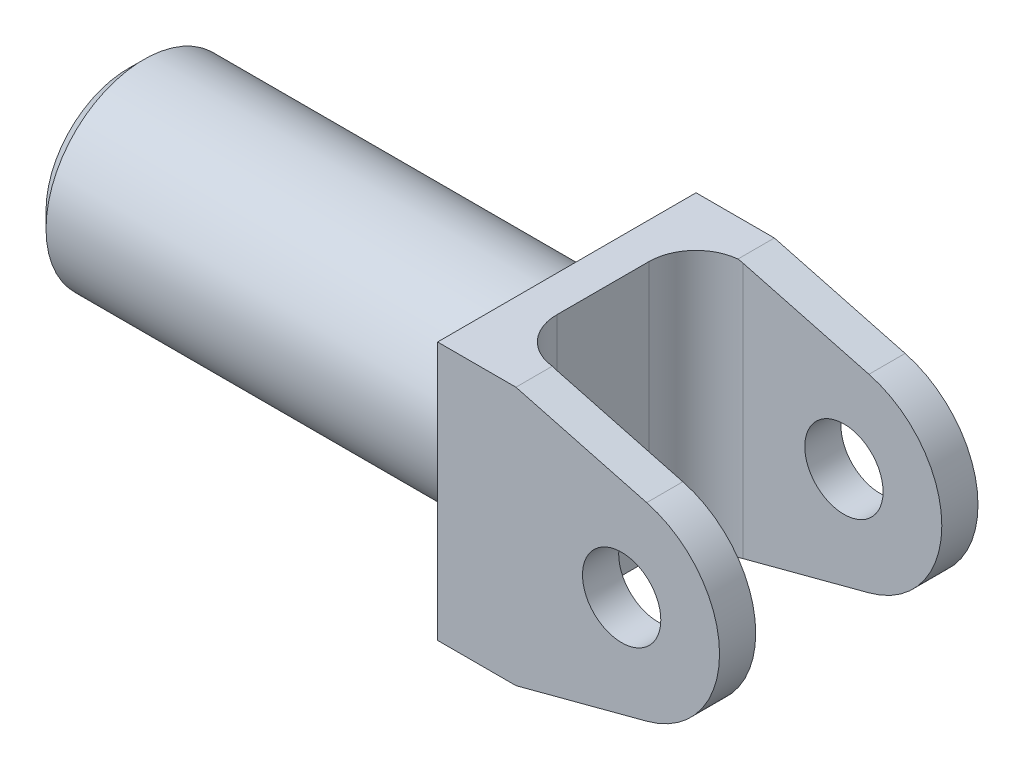
ISO-10303-21;
HEADER;
FILE_DESCRIPTION(('STEP AP214'),'2;1');
FILE_NAME('part.step','',(''),(''),'','','');
FILE_SCHEMA(('AUTOMOTIVE_DESIGN { 1 0 10303 214 1 1 1 1 }'));
ENDSEC;
DATA;
#1=APPLICATION_CONTEXT('core data for automotive mechanical design processes');
#2=APPLICATION_PROTOCOL_DEFINITION('international standard','automotive_design',2000,#1);
#3=PRODUCT_CONTEXT('',#1,'mechanical');
#4=PRODUCT('Part','Part','',(#3));
#5=PRODUCT_RELATED_PRODUCT_CATEGORY('part','',(#4));
#6=PRODUCT_DEFINITION_FORMATION('','',#4);
#7=PRODUCT_DEFINITION_CONTEXT('part definition',#1,'design');
#8=PRODUCT_DEFINITION('design','',#6,#7);
#9=PRODUCT_DEFINITION_SHAPE('','',#8);
#10=(LENGTH_UNIT() NAMED_UNIT(*) SI_UNIT(.MILLI.,.METRE.));
#11=(NAMED_UNIT(*) PLANE_ANGLE_UNIT() SI_UNIT($,.RADIAN.));
#12=(NAMED_UNIT(*) SI_UNIT($,.STERADIAN.) SOLID_ANGLE_UNIT());
#13=UNCERTAINTY_MEASURE_WITH_UNIT(LENGTH_MEASURE(1.E-05),#10,'distance_accuracy_value','');
#14=(GEOMETRIC_REPRESENTATION_CONTEXT(3) GLOBAL_UNCERTAINTY_ASSIGNED_CONTEXT((#13)) GLOBAL_UNIT_ASSIGNED_CONTEXT((#10,
#11,#12)) REPRESENTATION_CONTEXT('',''));
#15=CARTESIAN_POINT('',(0.,0.,0.));
#16=DIRECTION('',(0.,0.,1.));
#17=DIRECTION('',(1.,0.,0.));
#18=AXIS2_PLACEMENT_3D('',#15,#16,#17);
#19=CARTESIAN_POINT('',(0.,10.4775,10.4775));
#20=DIRECTION('',(1.,0.,0.));
#21=DIRECTION('',(0.,0.,-1.));
#22=AXIS2_PLACEMENT_3D('',#19,#20,#21);
#23=PLANE('',#22);
#24=DIRECTION('',(0.,-1.,0.));
#25=VECTOR('',#24,1.);
#26=CARTESIAN_POINT('',(0.,10.4775,-10.4775));
#27=LINE('',#26,#25);
#28=CARTESIAN_POINT('',(0.,10.4775,-10.4775));
#29=VERTEX_POINT('',#28);
#30=CARTESIAN_POINT('',(0.,0.,-10.4775));
#31=VERTEX_POINT('',#30);
#32=EDGE_CURVE('E218',#29,#31,#27,.T.);
#33=ORIENTED_EDGE('',*,*,#32,.T.);
#34=CARTESIAN_POINT('',(0.,0.,0.));
#35=DIRECTION('',(1.,0.,0.));
#36=DIRECTION('',(0.,0.,-1.));
#37=AXIS2_PLACEMENT_3D('',#34,#35,#36);
#38=CIRCLE('',#37,10.4775);
#39=CARTESIAN_POINT('',(0.,10.4775,0.));
#40=VERTEX_POINT('',#39);
#41=EDGE_CURVE('E247',#31,#40,#38,.T.);
#42=ORIENTED_EDGE('',*,*,#41,.T.);
#43=DIRECTION('',(0.,0.,1.));
#44=VECTOR('',#43,1.);
#45=CARTESIAN_POINT('',(0.,10.4775,10.4775));
#46=LINE('',#45,#44);
#47=EDGE_CURVE('E286',#29,#40,#46,.T.);
#48=ORIENTED_EDGE('',*,*,#47,.F.);
#49=EDGE_LOOP('',(#33,#42,#48));
#50=FACE_BOUND('',#49,.T.);
#51=ADVANCED_FACE('F64',(#50),#23,.F.);
#52=CARTESIAN_POINT('',(0.,10.4775,10.4775));
#53=VERTEX_POINT('',#52);
#54=EDGE_CURVE('E212',#40,#53,#46,.T.);
#55=ORIENTED_EDGE('',*,*,#54,.F.);
#56=CARTESIAN_POINT('',(0.,0.,0.));
#57=DIRECTION('',(1.,0.,0.));
#58=DIRECTION('',(0.,0.,-1.));
#59=AXIS2_PLACEMENT_3D('',#56,#57,#58);
#60=CIRCLE('',#59,10.4775);
#61=CARTESIAN_POINT('',(0.,0.,10.4775));
#62=VERTEX_POINT('',#61);
#63=EDGE_CURVE('E87',#40,#62,#60,.T.);
#64=ORIENTED_EDGE('',*,*,#63,.T.);
#65=DIRECTION('',(0.,-1.,0.));
#66=VECTOR('',#65,1.);
#67=CARTESIAN_POINT('',(0.,10.4775,10.4775));
#68=LINE('',#67,#66);
#69=EDGE_CURVE('E222',#53,#62,#68,.T.);
#70=ORIENTED_EDGE('',*,*,#69,.F.);
#71=EDGE_LOOP('',(#55,#64,#70));
#72=FACE_BOUND('',#71,.T.);
#73=ADVANCED_FACE('F263',(#72),#23,.F.);
#74=CARTESIAN_POINT('',(0.,-10.4775,10.4775));
#75=VERTEX_POINT('',#74);
#76=EDGE_CURVE('E206',#62,#75,#68,.T.);
#77=ORIENTED_EDGE('',*,*,#76,.F.);
#78=CARTESIAN_POINT('',(0.,0.,0.));
#79=DIRECTION('',(1.,0.,0.));
#80=DIRECTION('',(0.,0.,-1.));
#81=AXIS2_PLACEMENT_3D('',#78,#79,#80);
#82=CIRCLE('',#81,10.4775);
#83=CARTESIAN_POINT('',(0.,-10.4775,0.));
#84=VERTEX_POINT('',#83);
#85=EDGE_CURVE('E244',#62,#84,#82,.T.);
#86=ORIENTED_EDGE('',*,*,#85,.T.);
#87=DIRECTION('',(0.,0.,1.));
#88=VECTOR('',#87,1.);
#89=CARTESIAN_POINT('',(0.,-10.4775,10.4775));
#90=LINE('',#89,#88);
#91=EDGE_CURVE('E214',#84,#75,#90,.T.);
#92=ORIENTED_EDGE('',*,*,#91,.T.);
#93=EDGE_LOOP('',(#77,#86,#92));
#94=FACE_BOUND('',#93,.T.);
#95=ADVANCED_FACE('F270',(#94),#23,.F.);
#96=CARTESIAN_POINT('',(0.,-10.4775,-10.4775));
#97=VERTEX_POINT('',#96);
#98=EDGE_CURVE('E209',#97,#84,#90,.T.);
#99=ORIENTED_EDGE('',*,*,#98,.T.);
#100=CARTESIAN_POINT('',(0.,0.,0.));
#101=DIRECTION('',(1.,0.,0.));
#102=DIRECTION('',(0.,0.,-1.));
#103=AXIS2_PLACEMENT_3D('',#100,#101,#102);
#104=CIRCLE('',#103,10.4775);
#105=EDGE_CURVE('E79',#84,#31,#104,.T.);
#106=ORIENTED_EDGE('',*,*,#105,.T.);
#107=EDGE_CURVE('E221',#31,#97,#27,.T.);
#108=ORIENTED_EDGE('',*,*,#107,.T.);
#109=EDGE_LOOP('',(#99,#106,#108));
#110=FACE_BOUND('',#109,.T.);
#111=ADVANCED_FACE('F266',(#110),#23,.F.);
#112=CARTESIAN_POINT('',(0.,10.4775,10.4775));
#113=DIRECTION('',(0.,0.,-1.));
#114=DIRECTION('',(-1.,0.,0.));
#115=AXIS2_PLACEMENT_3D('',#112,#113,#114);
#116=PLANE('',#115);
#117=CARTESIAN_POINT('',(14.9225,0.,10.4775));
#118=DIRECTION('',(0.,0.,1.));
#119=DIRECTION('',(1.,0.,0.));
#120=AXIS2_PLACEMENT_3D('',#117,#118,#119);
#121=CIRCLE('',#120,3.175);
#122=CARTESIAN_POINT('',(18.0975,0.,10.4775));
#123=VERTEX_POINT('',#122);
#124=EDGE_CURVE('E362',#123,#123,#121,.T.);
#125=ORIENTED_EDGE('',*,*,#124,.F.);
#126=EDGE_LOOP('',(#125));
#127=FACE_BOUND('',#126,.T.);
#128=DIRECTION('',(0.966763182681634,0.255673519573848,0.));
#129=VECTOR('',#128,1.);
#130=CARTESIAN_POINT('',(7.69062346944128,-10.1229541018985,10.4775));
#131=LINE('',#130,#129);
#132=CARTESIAN_POINT('',(6.35000000000003,-10.4775,10.4775));
#133=VERTEX_POINT('',#132);
#134=CARTESIAN_POINT('',(16.9519085616174,-7.67368276253547,10.4775));
#135=VERTEX_POINT('',#134);
#136=EDGE_CURVE('E179',#133,#135,#131,.T.);
#137=ORIENTED_EDGE('',*,*,#136,.T.);
#138=CARTESIAN_POINT('',(14.9225,0.,10.4775));
#139=DIRECTION('',(0.,0.,1.));
#140=DIRECTION('',(1.,0.,0.));
#141=AXIS2_PLACEMENT_3D('',#138,#139,#140);
#142=CIRCLE('',#141,7.9375);
#143=CARTESIAN_POINT('',(16.9519085616174,7.67368276253546,10.4775));
#144=VERTEX_POINT('',#143);
#145=EDGE_CURVE('E339',#135,#144,#142,.T.);
#146=ORIENTED_EDGE('',*,*,#145,.T.);
#147=DIRECTION('',(0.966763182681634,-0.255673519573848,0.));
#148=VECTOR('',#147,1.);
#149=CARTESIAN_POINT('',(19.6847957598433,6.95093400556419,10.4775));
#150=LINE('',#149,#148);
#151=CARTESIAN_POINT('',(6.34999999999994,10.4775,10.4775));
#152=VERTEX_POINT('',#151);
#153=EDGE_CURVE('E335',#152,#144,#150,.T.);
#154=ORIENTED_EDGE('',*,*,#153,.F.);
#155=DIRECTION('',(1.,0.,0.));
#156=VECTOR('',#155,1.);
#157=CARTESIAN_POINT('',(0.,10.4775,10.4775));
#158=LINE('',#157,#156);
#159=EDGE_CURVE('E297',#53,#152,#158,.T.);
#160=ORIENTED_EDGE('',*,*,#159,.F.);
#161=ORIENTED_EDGE('',*,*,#69,.T.);
#162=ORIENTED_EDGE('',*,*,#76,.T.);
#163=DIRECTION('',(1.,0.,0.));
#164=VECTOR('',#163,1.);
#165=CARTESIAN_POINT('',(0.,-10.4775,10.4775));
#166=LINE('',#165,#164);
#167=EDGE_CURVE('E198',#75,#133,#166,.T.);
#168=ORIENTED_EDGE('',*,*,#167,.T.);
#169=EDGE_LOOP('',(#137,#146,#154,#160,#161,#162,#168));
#170=FACE_BOUND('',#169,.T.);
#171=ADVANCED_FACE('F203',(#127,#170),#116,.F.);
#172=CARTESIAN_POINT('',(0.,10.4775,-10.4775));
#173=DIRECTION('',(0.,0.,1.));
#174=DIRECTION('',(1.,0.,0.));
#175=AXIS2_PLACEMENT_3D('',#172,#173,#174);
#176=PLANE('',#175);
#177=CARTESIAN_POINT('',(14.9225,0.,-10.4775));
#178=DIRECTION('',(0.,0.,1.));
#179=DIRECTION('',(1.,0.,0.));
#180=AXIS2_PLACEMENT_3D('',#177,#178,#179);
#181=CIRCLE('',#180,3.175);
#182=CARTESIAN_POINT('',(18.0975,0.,-10.4775));
#183=VERTEX_POINT('',#182);
#184=EDGE_CURVE('E240',#183,#183,#181,.T.);
#185=ORIENTED_EDGE('',*,*,#184,.T.);
#186=EDGE_LOOP('',(#185));
#187=FACE_BOUND('',#186,.T.);
#188=CARTESIAN_POINT('',(14.9225,0.,-10.4775));
#189=DIRECTION('',(0.,0.,1.));
#190=DIRECTION('',(1.,0.,0.));
#191=AXIS2_PLACEMENT_3D('',#188,#189,#190);
#192=CIRCLE('',#191,7.9375);
#193=CARTESIAN_POINT('',(16.9519085616174,-7.67368276253547,-10.4775));
#194=VERTEX_POINT('',#193);
#195=CARTESIAN_POINT('',(16.9519085616174,7.67368276253546,-10.4775));
#196=VERTEX_POINT('',#195);
#197=EDGE_CURVE('E338',#194,#196,#192,.T.);
#198=ORIENTED_EDGE('',*,*,#197,.F.);
#199=DIRECTION('',(0.966763182681634,0.255673519573848,0.));
#200=VECTOR('',#199,1.);
#201=CARTESIAN_POINT('',(7.69062346944128,-10.1229541018985,-10.4775));
#202=LINE('',#201,#200);
#203=CARTESIAN_POINT('',(6.35000000000003,-10.4775,-10.4775));
#204=VERTEX_POINT('',#203);
#205=EDGE_CURVE('E354',#204,#194,#202,.T.);
#206=ORIENTED_EDGE('',*,*,#205,.F.);
#207=DIRECTION('',(-1.,0.,0.));
#208=VECTOR('',#207,1.);
#209=CARTESIAN_POINT('',(0.,-10.4775,-10.4775));
#210=LINE('',#209,#208);
#211=EDGE_CURVE('E208',#204,#97,#210,.T.);
#212=ORIENTED_EDGE('',*,*,#211,.T.);
#213=ORIENTED_EDGE('',*,*,#107,.F.);
#214=ORIENTED_EDGE('',*,*,#32,.F.);
#215=DIRECTION('',(-1.,0.,0.));
#216=VECTOR('',#215,1.);
#217=CARTESIAN_POINT('',(0.,10.4775,-10.4775));
#218=LINE('',#217,#216);
#219=CARTESIAN_POINT('',(6.34999999999994,10.4775,-10.4775));
#220=VERTEX_POINT('',#219);
#221=EDGE_CURVE('E296',#220,#29,#218,.T.);
#222=ORIENTED_EDGE('',*,*,#221,.F.);
#223=DIRECTION('',(0.966763182681634,-0.255673519573848,0.));
#224=VECTOR('',#223,1.);
#225=CARTESIAN_POINT('',(19.6847957598433,6.95093400556419,-10.4775));
#226=LINE('',#225,#224);
#227=EDGE_CURVE('E342',#220,#196,#226,.T.);
#228=ORIENTED_EDGE('',*,*,#227,.T.);
#229=EDGE_LOOP('',(#198,#206,#212,#213,#214,#222,#228));
#230=FACE_BOUND('',#229,.T.);
#231=ADVANCED_FACE('F278',(#187,#230),#176,.F.);
#232=CARTESIAN_POINT('',(6.73100000000002,83.4553894398251,-7.5438));
#233=DIRECTION('',(0.,0.,1.));
#234=DIRECTION('',(1.,0.,0.));
#235=AXIS2_PLACEMENT_3D('',#232,#233,#234);
#236=PLANE('',#235);
#237=CARTESIAN_POINT('',(14.9225,0.,-7.5438));
#238=DIRECTION('',(0.,0.,1.));
#239=DIRECTION('',(1.,0.,0.));
#240=AXIS2_PLACEMENT_3D('',#237,#238,#239);
#241=CIRCLE('',#240,3.175);
#242=CARTESIAN_POINT('',(18.0975,0.,-7.5438));
#243=VERTEX_POINT('',#242);
#244=EDGE_CURVE('E239',#243,#243,#241,.T.);
#245=ORIENTED_EDGE('',*,*,#244,.F.);
#246=EDGE_LOOP('',(#245));
#247=FACE_BOUND('',#246,.T.);
#248=DIRECTION('',(0.966763182681634,0.255673519573848,0.));
#249=VECTOR('',#248,1.);
#250=CARTESIAN_POINT('',(29.9240264058353,-4.24303181825958,-7.5438));
#251=LINE('',#250,#249);
#252=CARTESIAN_POINT('',(6.73100000000002,-10.3767394283288,-7.5438));
#253=VERTEX_POINT('',#252);
#254=CARTESIAN_POINT('',(16.9519085616174,-7.67368276253547,-7.5438));
#255=VERTEX_POINT('',#254);
#256=EDGE_CURVE('E341',#253,#255,#251,.T.);
#257=ORIENTED_EDGE('',*,*,#256,.T.);
#258=CARTESIAN_POINT('',(14.9225,0.,-7.5438));
#259=DIRECTION('',(0.,0.,1.));
#260=DIRECTION('',(1.,0.,0.));
#261=AXIS2_PLACEMENT_3D('',#258,#259,#260);
#262=CIRCLE('',#261,7.9375);
#263=CARTESIAN_POINT('',(16.9519085616174,7.67368276253546,-7.5438));
#264=VERTEX_POINT('',#263);
#265=EDGE_CURVE('E319',#255,#264,#262,.T.);
#266=ORIENTED_EDGE('',*,*,#265,.T.);
#267=DIRECTION('',(0.966763182681634,-0.255673519573848,0.));
#268=VECTOR('',#267,1.);
#269=CARTESIAN_POINT('',(-11.3322697975018,15.153813945512,-7.5438));
#270=LINE('',#269,#268);
#271=CARTESIAN_POINT('',(6.73100000000002,10.3767394283288,-7.5438));
#272=VERTEX_POINT('',#271);
#273=EDGE_CURVE('E322',#272,#264,#270,.T.);
#274=ORIENTED_EDGE('',*,*,#273,.F.);
#275=DIRECTION('',(0.,-1.,0.));
#276=VECTOR('',#275,1.);
#277=CARTESIAN_POINT('',(6.73100000000002,83.4553894398251,-7.5438));
#278=LINE('',#277,#276);
#279=EDGE_CURVE('E307',#272,#253,#278,.T.);
#280=ORIENTED_EDGE('',*,*,#279,.T.);
#281=EDGE_LOOP('',(#257,#266,#274,#280));
#282=FACE_BOUND('',#281,.T.);
#283=ADVANCED_FACE('F412',(#247,#282),#236,.T.);
#284=CARTESIAN_POINT('',(6.731,83.4553894398251,7.5438));
#285=DIRECTION('',(0.,0.,-1.));
#286=DIRECTION('',(-1.,0.,0.));
#287=AXIS2_PLACEMENT_3D('',#284,#285,#286);
#288=PLANE('',#287);
#289=CARTESIAN_POINT('',(14.9225,0.,7.5438));
#290=DIRECTION('',(0.,0.,-1.));
#291=DIRECTION('',(-1.,0.,0.));
#292=AXIS2_PLACEMENT_3D('',#289,#290,#291);
#293=CIRCLE('',#292,3.175);
#294=CARTESIAN_POINT('',(11.7475,0.,7.5438));
#295=VERTEX_POINT('',#294);
#296=EDGE_CURVE('E236',#295,#295,#293,.T.);
#297=ORIENTED_EDGE('',*,*,#296,.F.);
#298=EDGE_LOOP('',(#297));
#299=FACE_BOUND('',#298,.T.);
#300=CARTESIAN_POINT('',(14.9225,0.,7.5438));
#301=DIRECTION('',(0.,0.,-1.));
#302=DIRECTION('',(-1.,0.,0.));
#303=AXIS2_PLACEMENT_3D('',#300,#301,#302);
#304=CIRCLE('',#303,7.9375);
#305=CARTESIAN_POINT('',(16.9519085616174,7.67368276253547,7.5438));
#306=VERTEX_POINT('',#305);
#307=CARTESIAN_POINT('',(16.9519085616174,-7.67368276253547,7.5438));
#308=VERTEX_POINT('',#307);
#309=EDGE_CURVE('E231',#306,#308,#304,.T.);
#310=ORIENTED_EDGE('',*,*,#309,.T.);
#311=DIRECTION('',(-0.966763182681634,-0.255673519573848,0.));
#312=VECTOR('',#311,1.);
#313=CARTESIAN_POINT('',(29.9240264058353,-4.24303181825959,7.5438));
#314=LINE('',#313,#312);
#315=CARTESIAN_POINT('',(6.731,-10.3767394283288,7.5438));
#316=VERTEX_POINT('',#315);
#317=EDGE_CURVE('E351',#308,#316,#314,.T.);
#318=ORIENTED_EDGE('',*,*,#317,.T.);
#319=DIRECTION('',(0.,-1.,0.));
#320=VECTOR('',#319,1.);
#321=CARTESIAN_POINT('',(6.731,83.4553894398251,7.5438));
#322=LINE('',#321,#320);
#323=CARTESIAN_POINT('',(6.731,10.3767394283288,7.5438));
#324=VERTEX_POINT('',#323);
#325=EDGE_CURVE('E316',#324,#316,#322,.T.);
#326=ORIENTED_EDGE('',*,*,#325,.F.);
#327=DIRECTION('',(-0.966763182681634,0.255673519573848,0.));
#328=VECTOR('',#327,1.);
#329=CARTESIAN_POINT('',(-11.3322697975019,15.153813945512,7.5438));
#330=LINE('',#329,#328);
#331=EDGE_CURVE('E229',#306,#324,#330,.T.);
#332=ORIENTED_EDGE('',*,*,#331,.F.);
#333=EDGE_LOOP('',(#310,#318,#326,#332));
#334=FACE_BOUND('',#333,.T.);
#335=ADVANCED_FACE('F409',(#299,#334),#288,.T.);
#336=CARTESIAN_POINT('',(0.,-10.4775,-10.4775));
#337=DIRECTION('',(0.,-1.,0.));
#338=DIRECTION('',(0.,0.,-1.));
#339=AXIS2_PLACEMENT_3D('',#336,#337,#338);
#340=PLANE('',#339);
#341=ORIENTED_EDGE('',*,*,#211,.F.);
#342=DIRECTION('',(0.,0.,1.));
#343=VECTOR('',#342,1.);
#344=CARTESIAN_POINT('',(6.35000000000003,-10.4775,-10.4775));
#345=LINE('',#344,#343);
#346=CARTESIAN_POINT('',(6.35000000000003,-10.4775,-7.52470213537623));
#347=VERTEX_POINT('',#346);
#348=EDGE_CURVE('E201',#204,#347,#345,.T.);
#349=ORIENTED_EDGE('',*,*,#348,.T.);
#350=CARTESIAN_POINT('',(6.731,-10.4775,-3.7338));
#351=DIRECTION('',(0.,-1.,0.));
#352=DIRECTION('',(0.,0.,-1.));
#353=AXIS2_PLACEMENT_3D('',#350,#351,#352);
#354=CIRCLE('',#353,3.81);
#355=CARTESIAN_POINT('',(2.921,-10.4775,-3.73379999999997));
#356=VERTEX_POINT('',#355);
#357=EDGE_CURVE('E227',#347,#356,#354,.F.);
#358=ORIENTED_EDGE('',*,*,#357,.T.);
#359=DIRECTION('',(0.,0.,1.));
#360=VECTOR('',#359,1.);
#361=CARTESIAN_POINT('',(2.92100000000002,-10.4775,-10.4775));
#362=LINE('',#361,#360);
#363=CARTESIAN_POINT('',(2.92099999999997,-10.4775,3.73379999999997));
#364=VERTEX_POINT('',#363);
#365=EDGE_CURVE('E225',#356,#364,#362,.T.);
#366=ORIENTED_EDGE('',*,*,#365,.T.);
#367=CARTESIAN_POINT('',(6.73099999999997,-10.4775,3.7338));
#368=DIRECTION('',(0.,-1.,0.));
#369=DIRECTION('',(0.,0.,-1.));
#370=AXIS2_PLACEMENT_3D('',#367,#368,#369);
#371=CIRCLE('',#370,3.81);
#372=CARTESIAN_POINT('',(6.35000000000003,-10.4775,7.52470213537622));
#373=VERTEX_POINT('',#372);
#374=EDGE_CURVE('E200',#364,#373,#371,.F.);
#375=ORIENTED_EDGE('',*,*,#374,.T.);
#376=EDGE_CURVE('E182',#373,#133,#345,.T.);
#377=ORIENTED_EDGE('',*,*,#376,.T.);
#378=ORIENTED_EDGE('',*,*,#167,.F.);
#379=ORIENTED_EDGE('',*,*,#91,.F.);
#380=ORIENTED_EDGE('',*,*,#98,.F.);
#381=EDGE_LOOP('',(#341,#349,#358,#366,#375,#377,#378,#379,#380));
#382=FACE_BOUND('',#381,.T.);
#383=ADVANCED_FACE('F196',(#382),#340,.T.);
#384=CARTESIAN_POINT('',(6.731,83.4553894398251,-3.7338));
#385=DIRECTION('',(0.,-1.,0.));
#386=DIRECTION('',(0.,0.,-1.));
#387=AXIS2_PLACEMENT_3D('',#384,#385,#386);
#388=CYLINDRICAL_SURFACE('',#387,3.81);
#389=ORIENTED_EDGE('',*,*,#357,.F.);
#390=CARTESIAN_POINT('',(6.731,-10.3767394283288,-3.7338));
#391=DIRECTION('',(0.255673519573848,-0.966763182681633,0.));
#392=DIRECTION('',(-0.966763182681634,-0.255673519573848,0.));
#393=AXIS2_PLACEMENT_3D('',#390,#391,#392);
#394=ELLIPSE('',#393,3.94098582595142,3.81);
#395=EDGE_CURVE('E348',#347,#253,#394,.T.);
#396=ORIENTED_EDGE('',*,*,#395,.T.);
#397=ORIENTED_EDGE('',*,*,#279,.F.);
#398=CARTESIAN_POINT('',(6.731,10.3767394283288,-3.7338));
#399=DIRECTION('',(-0.255673519573848,-0.966763182681633,0.));
#400=DIRECTION('',(0.966763182681634,-0.255673519573848,0.));
#401=AXIS2_PLACEMENT_3D('',#398,#399,#400);
#402=ELLIPSE('',#401,3.94098582595142,3.81);
#403=CARTESIAN_POINT('',(6.34999999999994,10.4775,-7.52470213537622));
#404=VERTEX_POINT('',#403);
#405=EDGE_CURVE('E324',#404,#272,#402,.T.);
#406=ORIENTED_EDGE('',*,*,#405,.F.);
#407=CARTESIAN_POINT('',(6.731,10.4775,-3.7338));
#408=DIRECTION('',(0.,-1.,0.));
#409=DIRECTION('',(0.,0.,-1.));
#410=AXIS2_PLACEMENT_3D('',#407,#408,#409);
#411=CIRCLE('',#410,3.81);
#412=CARTESIAN_POINT('',(2.921,10.4775,-3.73379999999997));
#413=VERTEX_POINT('',#412);
#414=EDGE_CURVE('E300',#404,#413,#411,.F.);
#415=ORIENTED_EDGE('',*,*,#414,.T.);
#416=DIRECTION('',(0.,-1.,0.));
#417=VECTOR('',#416,1.);
#418=CARTESIAN_POINT('',(2.921,83.4553894398251,-3.73379999999997));
#419=LINE('',#418,#417);
#420=EDGE_CURVE('E310',#413,#356,#419,.T.);
#421=ORIENTED_EDGE('',*,*,#420,.T.);
#422=EDGE_LOOP('',(#389,#396,#397,#406,#415,#421));
#423=FACE_BOUND('',#422,.T.);
#424=ADVANCED_FACE('F417',(#423),#388,.F.);
#425=CARTESIAN_POINT('',(6.73099999999997,83.4553894398251,3.7338));
#426=DIRECTION('',(0.,-1.,0.));
#427=DIRECTION('',(0.,0.,-1.));
#428=AXIS2_PLACEMENT_3D('',#425,#426,#427);
#429=CYLINDRICAL_SURFACE('',#428,3.81);
#430=ORIENTED_EDGE('',*,*,#325,.T.);
#431=CARTESIAN_POINT('',(6.73099999999997,-10.3767394283288,3.7338));
#432=DIRECTION('',(0.255673519573848,-0.966763182681633,0.));
#433=DIRECTION('',(-0.966763182681634,-0.255673519573848,0.));
#434=AXIS2_PLACEMENT_3D('',#431,#432,#433);
#435=ELLIPSE('',#434,3.94098582595142,3.81);
#436=EDGE_CURVE('E233',#316,#373,#435,.T.);
#437=ORIENTED_EDGE('',*,*,#436,.T.);
#438=ORIENTED_EDGE('',*,*,#374,.F.);
#439=DIRECTION('',(0.,-1.,0.));
#440=VECTOR('',#439,1.);
#441=CARTESIAN_POINT('',(2.92099999999997,83.4553894398251,3.73379999999997));
#442=LINE('',#441,#440);
#443=CARTESIAN_POINT('',(2.92099999999997,10.4775,3.73379999999997));
#444=VERTEX_POINT('',#443);
#445=EDGE_CURVE('E313',#444,#364,#442,.T.);
#446=ORIENTED_EDGE('',*,*,#445,.F.);
#447=CARTESIAN_POINT('',(6.73099999999997,10.4775,3.7338));
#448=DIRECTION('',(0.,-1.,0.));
#449=DIRECTION('',(0.,0.,-1.));
#450=AXIS2_PLACEMENT_3D('',#447,#448,#449);
#451=CIRCLE('',#450,3.81);
#452=CARTESIAN_POINT('',(6.34999999999994,10.4775,7.52470213537622));
#453=VERTEX_POINT('',#452);
#454=EDGE_CURVE('E304',#444,#453,#451,.F.);
#455=ORIENTED_EDGE('',*,*,#454,.T.);
#456=CARTESIAN_POINT('',(6.73099999999997,10.3767394283288,3.7338));
#457=DIRECTION('',(-0.255673519573848,-0.966763182681633,0.));
#458=DIRECTION('',(0.966763182681634,-0.255673519573848,0.));
#459=AXIS2_PLACEMENT_3D('',#456,#457,#458);
#460=ELLIPSE('',#459,3.94098582595142,3.81);
#461=EDGE_CURVE('E326',#324,#453,#460,.T.);
#462=ORIENTED_EDGE('',*,*,#461,.F.);
#463=EDGE_LOOP('',(#430,#437,#438,#446,#455,#462));
#464=FACE_BOUND('',#463,.T.);
#465=ADVANCED_FACE('F414',(#464),#429,.F.);
#466=CARTESIAN_POINT('',(0.,10.4775,-10.4775));
#467=DIRECTION('',(0.,-1.,0.));
#468=DIRECTION('',(0.,0.,-1.));
#469=AXIS2_PLACEMENT_3D('',#466,#467,#468);
#470=PLANE('',#469);
#471=ORIENTED_EDGE('',*,*,#159,.T.);
#472=DIRECTION('',(0.,0.,1.));
#473=VECTOR('',#472,1.);
#474=CARTESIAN_POINT('',(6.34999999999994,10.4775,-10.4775));
#475=LINE('',#474,#473);
#476=EDGE_CURVE('E332',#453,#152,#475,.T.);
#477=ORIENTED_EDGE('',*,*,#476,.F.);
#478=ORIENTED_EDGE('',*,*,#454,.F.);
#479=DIRECTION('',(0.,0.,1.));
#480=VECTOR('',#479,1.);
#481=CARTESIAN_POINT('',(2.92100000000002,10.4775,-10.4775));
#482=LINE('',#481,#480);
#483=EDGE_CURVE('E302',#413,#444,#482,.T.);
#484=ORIENTED_EDGE('',*,*,#483,.F.);
#485=ORIENTED_EDGE('',*,*,#414,.F.);
#486=EDGE_CURVE('E329',#220,#404,#475,.T.);
#487=ORIENTED_EDGE('',*,*,#486,.F.);
#488=ORIENTED_EDGE('',*,*,#221,.T.);
#489=ORIENTED_EDGE('',*,*,#47,.T.);
#490=ORIENTED_EDGE('',*,*,#54,.T.);
#491=EDGE_LOOP('',(#471,#477,#478,#484,#485,#487,#488,#489,#490));
#492=FACE_BOUND('',#491,.T.);
#493=ADVANCED_FACE('F293',(#492),#470,.F.);
#494=CARTESIAN_POINT('',(2.92099999999997,83.4553894398251,3.73379999999997));
#495=DIRECTION('',(1.,0.,0.));
#496=DIRECTION('',(0.,0.,-1.));
#497=AXIS2_PLACEMENT_3D('',#494,#495,#496);
#498=PLANE('',#497);
#499=ORIENTED_EDGE('',*,*,#420,.F.);
#500=ORIENTED_EDGE('',*,*,#483,.T.);
#501=ORIENTED_EDGE('',*,*,#445,.T.);
#502=ORIENTED_EDGE('',*,*,#365,.F.);
#503=EDGE_LOOP('',(#499,#500,#501,#502));
#504=FACE_BOUND('',#503,.T.);
#505=ADVANCED_FACE('F402',(#504),#498,.T.);
#506=CARTESIAN_POINT('',(19.6847957598433,6.95093400556419,-10.4775));
#507=DIRECTION('',(-0.255673519573848,-0.966763182681633,0.));
#508=DIRECTION('',(0.966763182681634,-0.255673519573848,0.));
#509=AXIS2_PLACEMENT_3D('',#506,#507,#508);
#510=PLANE('',#509);
#511=ORIENTED_EDGE('',*,*,#461,.T.);
#512=ORIENTED_EDGE('',*,*,#476,.T.);
#513=ORIENTED_EDGE('',*,*,#153,.T.);
#514=DIRECTION('',(0.,0.,1.));
#515=VECTOR('',#514,1.);
#516=CARTESIAN_POINT('',(16.9519085616174,7.67368276253546,-10.4775));
#517=LINE('',#516,#515);
#518=EDGE_CURVE('E331',#306,#144,#517,.T.);
#519=ORIENTED_EDGE('',*,*,#518,.F.);
#520=ORIENTED_EDGE('',*,*,#331,.T.);
#521=EDGE_LOOP('',(#511,#512,#513,#519,#520));
#522=FACE_BOUND('',#521,.T.);
#523=ADVANCED_FACE('F398',(#522),#510,.F.);
#524=CARTESIAN_POINT('',(14.9225,0.,-10.4775));
#525=DIRECTION('',(0.,0.,1.));
#526=DIRECTION('',(1.,0.,0.));
#527=AXIS2_PLACEMENT_3D('',#524,#525,#526);
#528=CYLINDRICAL_SURFACE('',#527,7.9375);
#529=ORIENTED_EDGE('',*,*,#518,.T.);
#530=ORIENTED_EDGE('',*,*,#145,.F.);
#531=DIRECTION('',(0.,0.,1.));
#532=VECTOR('',#531,1.);
#533=CARTESIAN_POINT('',(16.9519085616174,-7.67368276253547,-10.4775));
#534=LINE('',#533,#532);
#535=EDGE_CURVE('E186',#308,#135,#534,.T.);
#536=ORIENTED_EDGE('',*,*,#535,.F.);
#537=ORIENTED_EDGE('',*,*,#309,.F.);
#538=EDGE_LOOP('',(#529,#530,#536,#537));
#539=FACE_BOUND('',#538,.T.);
#540=ADVANCED_FACE('F401',(#539),#528,.T.);
#541=ORIENTED_EDGE('',*,*,#265,.F.);
#542=EDGE_CURVE('E190',#194,#255,#534,.T.);
#543=ORIENTED_EDGE('',*,*,#542,.F.);
#544=ORIENTED_EDGE('',*,*,#197,.T.);
#545=EDGE_CURVE('E328',#196,#264,#517,.T.);
#546=ORIENTED_EDGE('',*,*,#545,.T.);
#547=EDGE_LOOP('',(#541,#543,#544,#546));
#548=FACE_BOUND('',#547,.T.);
#549=ADVANCED_FACE('F407',(#548),#528,.T.);
#550=ORIENTED_EDGE('',*,*,#273,.T.);
#551=ORIENTED_EDGE('',*,*,#545,.F.);
#552=ORIENTED_EDGE('',*,*,#227,.F.);
#553=ORIENTED_EDGE('',*,*,#486,.T.);
#554=ORIENTED_EDGE('',*,*,#405,.T.);
#555=EDGE_LOOP('',(#550,#551,#552,#553,#554));
#556=FACE_BOUND('',#555,.T.);
#557=ADVANCED_FACE('F404',(#556),#510,.F.);
#558=CARTESIAN_POINT('',(7.69062346944128,-10.1229541018985,-10.4775));
#559=DIRECTION('',(0.255673519573848,-0.966763182681633,0.));
#560=DIRECTION('',(0.966763182681634,0.255673519573848,0.));
#561=AXIS2_PLACEMENT_3D('',#558,#559,#560);
#562=PLANE('',#561);
#563=ORIENTED_EDGE('',*,*,#395,.F.);
#564=ORIENTED_EDGE('',*,*,#348,.F.);
#565=ORIENTED_EDGE('',*,*,#205,.T.);
#566=ORIENTED_EDGE('',*,*,#542,.T.);
#567=ORIENTED_EDGE('',*,*,#256,.F.);
#568=EDGE_LOOP('',(#563,#564,#565,#566,#567));
#569=FACE_BOUND('',#568,.T.);
#570=ADVANCED_FACE('F397',(#569),#562,.T.);
#571=ORIENTED_EDGE('',*,*,#535,.T.);
#572=ORIENTED_EDGE('',*,*,#136,.F.);
#573=ORIENTED_EDGE('',*,*,#376,.F.);
#574=ORIENTED_EDGE('',*,*,#436,.F.);
#575=ORIENTED_EDGE('',*,*,#317,.F.);
#576=EDGE_LOOP('',(#571,#572,#573,#574,#575));
#577=FACE_BOUND('',#576,.T.);
#578=ADVANCED_FACE('F181',(#577),#562,.T.);
#579=CARTESIAN_POINT('',(14.9225,0.,-10.4775));
#580=DIRECTION('',(0.,0.,1.));
#581=DIRECTION('',(1.,0.,0.));
#582=AXIS2_PLACEMENT_3D('',#579,#580,#581);
#583=CYLINDRICAL_SURFACE('',#582,3.175);
#584=ORIENTED_EDGE('',*,*,#296,.T.);
#585=EDGE_LOOP('',(#584));
#586=FACE_BOUND('',#585,.T.);
#587=ORIENTED_EDGE('',*,*,#124,.T.);
#588=EDGE_LOOP('',(#587));
#589=FACE_BOUND('',#588,.T.);
#590=ADVANCED_FACE('F391',(#586,#589),#583,.F.);
#591=ORIENTED_EDGE('',*,*,#244,.T.);
#592=EDGE_LOOP('',(#591));
#593=FACE_BOUND('',#592,.T.);
#594=ORIENTED_EDGE('',*,*,#184,.F.);
#595=EDGE_LOOP('',(#594));
#596=FACE_BOUND('',#595,.T.);
#597=ADVANCED_FACE('F386',(#593,#596),#583,.F.);
#598=CARTESIAN_POINT('',(-35.56,0.,0.));
#599=DIRECTION('',(1.,0.,0.));
#600=DIRECTION('',(0.,0.,-1.));
#601=AXIS2_PLACEMENT_3D('',#598,#599,#600);
#602=CYLINDRICAL_SURFACE('',#601,7.9375);
#603=CARTESIAN_POINT('',(-34.29,0.,0.));
#604=DIRECTION('',(-1.,0.,0.));
#605=DIRECTION('',(0.,0.,1.));
#606=AXIS2_PLACEMENT_3D('',#603,#604,#605);
#607=CIRCLE('',#606,7.9375);
#608=CARTESIAN_POINT('',(-34.29,0.,7.93750000000001));
#609=VERTEX_POINT('',#608);
#610=EDGE_CURVE('E12',#609,#609,#607,.F.);
#611=ORIENTED_EDGE('',*,*,#610,.T.);
#612=EDGE_LOOP('',(#611));
#613=FACE_BOUND('',#612,.T.);
#614=CARTESIAN_POINT('',(-2.54,0.,0.));
#615=DIRECTION('',(1.,0.,0.));
#616=DIRECTION('',(0.,0.,-1.));
#617=AXIS2_PLACEMENT_3D('',#614,#615,#616);
#618=CIRCLE('',#617,7.9375);
#619=CARTESIAN_POINT('',(-2.54,0.,-7.9375));
#620=VERTEX_POINT('',#619);
#621=EDGE_CURVE('E235',#620,#620,#618,.F.);
#622=ORIENTED_EDGE('',*,*,#621,.T.);
#623=EDGE_LOOP('',(#622));
#624=FACE_BOUND('',#623,.T.);
#625=ADVANCED_FACE('F381',(#613,#624),#602,.T.);
#626=CARTESIAN_POINT('',(-35.56,0.,0.));
#627=DIRECTION('',(-1.,0.,0.));
#628=DIRECTION('',(0.,0.,1.));
#629=AXIS2_PLACEMENT_3D('',#626,#627,#628);
#630=PLANE('',#629);
#631=CARTESIAN_POINT('',(-35.56,0.,0.));
#632=DIRECTION('',(-1.,0.,0.));
#633=DIRECTION('',(0.,0.,1.));
#634=AXIS2_PLACEMENT_3D('',#631,#632,#633);
#635=CIRCLE('',#634,6.66749999999998);
#636=CARTESIAN_POINT('',(-35.56,0.,6.66749999999999));
#637=VERTEX_POINT('',#636);
#638=EDGE_CURVE('E72',#637,#637,#635,.T.);
#639=ORIENTED_EDGE('',*,*,#638,.T.);
#640=EDGE_LOOP('',(#639));
#641=FACE_BOUND('',#640,.T.);
#642=CARTESIAN_POINT('',(-35.56,0.,0.));
#643=DIRECTION('',(-1.,0.,0.));
#644=DIRECTION('',(0.,0.,1.));
#645=AXIS2_PLACEMENT_3D('',#642,#643,#644);
#646=CIRCLE('',#645,4.7625);
#647=CARTESIAN_POINT('',(-35.56,0.,4.76250000000001));
#648=VERTEX_POINT('',#647);
#649=EDGE_CURVE('E368',#648,#648,#646,.T.);
#650=ORIENTED_EDGE('',*,*,#649,.F.);
#651=EDGE_LOOP('',(#650));
#652=FACE_BOUND('',#651,.T.);
#653=ADVANCED_FACE('F251',(#641,#652),#630,.T.);
#654=CARTESIAN_POINT('',(-4.31799999999994,0.,0.));
#655=DIRECTION('',(-1.,0.,0.));
#656=DIRECTION('',(0.,0.,1.));
#657=AXIS2_PLACEMENT_3D('',#654,#655,#656);
#658=CYLINDRICAL_SURFACE('',#657,4.7625);
#659=CARTESIAN_POINT('',(-4.31799999999994,0.,0.));
#660=DIRECTION('',(-1.,0.,0.));
#661=DIRECTION('',(0.,0.,1.));
#662=AXIS2_PLACEMENT_3D('',#659,#660,#661);
#663=CIRCLE('',#662,4.7625);
#664=CARTESIAN_POINT('',(-4.31799999999994,0.,4.7625));
#665=VERTEX_POINT('',#664);
#666=EDGE_CURVE('E365',#665,#665,#663,.T.);
#667=ORIENTED_EDGE('',*,*,#666,.F.);
#668=EDGE_LOOP('',(#667));
#669=FACE_BOUND('',#668,.T.);
#670=ORIENTED_EDGE('',*,*,#649,.T.);
#671=EDGE_LOOP('',(#670));
#672=FACE_BOUND('',#671,.T.);
#673=ADVANCED_FACE('F375',(#669,#672),#658,.F.);
#674=CARTESIAN_POINT('',(-4.31799999999994,0.,0.));
#675=DIRECTION('',(-1.,0.,0.));
#676=DIRECTION('',(0.,0.,1.));
#677=AXIS2_PLACEMENT_3D('',#674,#675,#676);
#678=PLANE('',#677);
#679=ORIENTED_EDGE('',*,*,#666,.T.);
#680=EDGE_LOOP('',(#679));
#681=FACE_BOUND('',#680,.T.);
#682=ADVANCED_FACE('F260',(#681),#678,.T.);
#683=CARTESIAN_POINT('',(-2.54,0.,0.));
#684=DIRECTION('',(1.,0.,0.));
#685=DIRECTION('',(0.,0.,-1.));
#686=AXIS2_PLACEMENT_3D('',#683,#684,#685);
#687=TOROIDAL_SURFACE('',#686,10.4775,2.54);
#688=ORIENTED_EDGE('',*,*,#63,.F.);
#689=ORIENTED_EDGE('',*,*,#41,.F.);
#690=ORIENTED_EDGE('',*,*,#105,.F.);
#691=ORIENTED_EDGE('',*,*,#85,.F.);
#692=EDGE_LOOP('',(#688,#689,#690,#691));
#693=FACE_BOUND('',#692,.T.);
#694=ORIENTED_EDGE('',*,*,#621,.F.);
#695=EDGE_LOOP('',(#694));
#696=FACE_BOUND('',#695,.T.);
#697=ADVANCED_FACE('F255',(#693,#696),#687,.F.);
#698=CARTESIAN_POINT('',(-35.56,0.,0.));
#699=DIRECTION('',(1.,0.,0.));
#700=DIRECTION('',(0.,0.,-1.));
#701=AXIS2_PLACEMENT_3D('',#698,#699,#700);
#702=CONICAL_SURFACE('',#701,6.66749999999998,0.785398163397449);
#703=ORIENTED_EDGE('',*,*,#610,.F.);
#704=EDGE_LOOP('',(#703));
#705=FACE_BOUND('',#704,.T.);
#706=ORIENTED_EDGE('',*,*,#638,.F.);
#707=EDGE_LOOP('',(#706));
#708=FACE_BOUND('',#707,.T.);
#709=ADVANCED_FACE('F66',(#705,#708),#702,.T.);
#710=CLOSED_SHELL('',(#51,#73,#95,#111,#171,#231,#283,#335,#383,#424,#465,#493,#505,#523,#540,
#549,#557,#570,#578,#590,#597,#625,#653,#673,#682,#697,#709));
#711=MANIFOLD_SOLID_BREP('B2',#710);
#712=ADVANCED_BREP_SHAPE_REPRESENTATION('',(#18,#711),#14);
#713=SHAPE_DEFINITION_REPRESENTATION(#9,#712);
ENDSEC;
END-ISO-10303-21;
